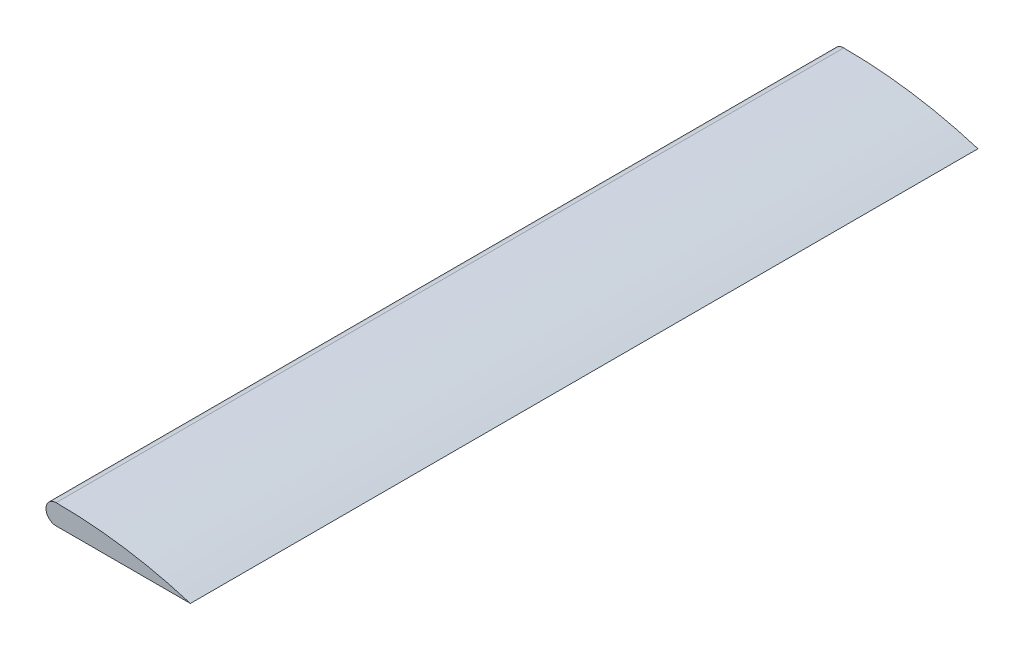
ISO-10303-21;
HEADER;
FILE_DESCRIPTION(('STEP AP214'),'2;1');
FILE_NAME('part.step','',(''),(''),'','','');
FILE_SCHEMA(('AUTOMOTIVE_DESIGN { 1 0 10303 214 1 1 1 1 }'));
ENDSEC;
DATA;
#1=APPLICATION_CONTEXT('core data for automotive mechanical design processes');
#2=APPLICATION_PROTOCOL_DEFINITION('international standard','automotive_design',2000,#1);
#3=PRODUCT_CONTEXT('',#1,'mechanical');
#4=PRODUCT('Part','Part','',(#3));
#5=PRODUCT_RELATED_PRODUCT_CATEGORY('part','',(#4));
#6=PRODUCT_DEFINITION_FORMATION('','',#4);
#7=PRODUCT_DEFINITION_CONTEXT('part definition',#1,'design');
#8=PRODUCT_DEFINITION('design','',#6,#7);
#9=PRODUCT_DEFINITION_SHAPE('','',#8);
#10=(LENGTH_UNIT() NAMED_UNIT(*) SI_UNIT(.MILLI.,.METRE.));
#11=(NAMED_UNIT(*) PLANE_ANGLE_UNIT() SI_UNIT($,.RADIAN.));
#12=(NAMED_UNIT(*) SI_UNIT($,.STERADIAN.) SOLID_ANGLE_UNIT());
#13=UNCERTAINTY_MEASURE_WITH_UNIT(LENGTH_MEASURE(1.E-05),#10,'distance_accuracy_value','');
#14=(GEOMETRIC_REPRESENTATION_CONTEXT(3) GLOBAL_UNCERTAINTY_ASSIGNED_CONTEXT((#13)) GLOBAL_UNIT_ASSIGNED_CONTEXT((#10,
#11,#12)) REPRESENTATION_CONTEXT('',''));
#15=CARTESIAN_POINT('',(0.,0.,0.));
#16=DIRECTION('',(0.,0.,1.));
#17=DIRECTION('',(1.,0.,0.));
#18=AXIS2_PLACEMENT_3D('',#15,#16,#17);
#19=CARTESIAN_POINT('',(0.,15.3731710536713,1200.));
#20=DIRECTION('',(0.,0.,-1.));
#21=DIRECTION('',(-1.,0.,0.));
#22=AXIS2_PLACEMENT_3D('',#19,#20,#21);
#23=CYLINDRICAL_SURFACE('',#22,15.3731710536713);
#24=CARTESIAN_POINT('',(0.,15.3731710536713,0.));
#25=DIRECTION('',(0.,0.,1.));
#26=DIRECTION('',(-1.,0.,0.));
#27=AXIS2_PLACEMENT_3D('',#24,#25,#26);
#28=CIRCLE('',#27,15.3731710536713);
#29=CARTESIAN_POINT('',(0.,30.7463421073426,0.));
#30=VERTEX_POINT('',#29);
#31=CARTESIAN_POINT('',(0.,0.,0.));
#32=VERTEX_POINT('',#31);
#33=EDGE_CURVE('E93',#30,#32,#28,.T.);
#34=ORIENTED_EDGE('',*,*,#33,.T.);
#35=DIRECTION('',(0.,0.,-1.));
#36=VECTOR('',#35,1.);
#37=CARTESIAN_POINT('',(0.,0.,1200.));
#38=LINE('',#37,#36);
#39=CARTESIAN_POINT('',(0.,0.,1200.));
#40=VERTEX_POINT('',#39);
#41=EDGE_CURVE('E11',#40,#32,#38,.T.);
#42=ORIENTED_EDGE('',*,*,#41,.F.);
#43=CARTESIAN_POINT('',(0.,15.3731710536713,1200.));
#44=DIRECTION('',(0.,0.,1.));
#45=DIRECTION('',(-1.,0.,0.));
#46=AXIS2_PLACEMENT_3D('',#43,#44,#45);
#47=CIRCLE('',#46,15.3731710536713);
#48=CARTESIAN_POINT('',(0.,30.7463421073426,1200.));
#49=VERTEX_POINT('',#48);
#50=EDGE_CURVE('E85',#49,#40,#47,.T.);
#51=ORIENTED_EDGE('',*,*,#50,.F.);
#52=DIRECTION('',(0.,0.,-1.));
#53=VECTOR('',#52,1.);
#54=CARTESIAN_POINT('',(0.,30.7463421073426,1200.));
#55=LINE('',#54,#53);
#56=EDGE_CURVE('E94',#49,#30,#55,.T.);
#57=ORIENTED_EDGE('',*,*,#56,.T.);
#58=EDGE_LOOP('',(#34,#42,#51,#57));
#59=FACE_BOUND('',#58,.T.);
#60=ADVANCED_FACE('F43',(#59),#23,.T.);
#61=CARTESIAN_POINT('',(0.,0.,1200.));
#62=DIRECTION('',(0.,1.,0.));
#63=DIRECTION('',(0.,0.,1.));
#64=AXIS2_PLACEMENT_3D('',#61,#62,#63);
#65=PLANE('',#64);
#66=DIRECTION('',(1.,0.,0.));
#67=VECTOR('',#66,1.);
#68=CARTESIAN_POINT('',(0.,0.,0.));
#69=LINE('',#68,#67);
#70=CARTESIAN_POINT('',(204.626828946329,0.,0.));
#71=VERTEX_POINT('',#70);
#72=EDGE_CURVE('E72',#32,#71,#69,.T.);
#73=ORIENTED_EDGE('',*,*,#72,.T.);
#74=DIRECTION('',(0.,0.,-1.));
#75=VECTOR('',#74,1.);
#76=CARTESIAN_POINT('',(204.626828946329,0.,1200.));
#77=LINE('',#76,#75);
#78=CARTESIAN_POINT('',(204.626828946329,0.,1200.));
#79=VERTEX_POINT('',#78);
#80=EDGE_CURVE('E52',#79,#71,#77,.T.);
#81=ORIENTED_EDGE('',*,*,#80,.F.);
#82=DIRECTION('',(1.,0.,0.));
#83=VECTOR('',#82,1.);
#84=CARTESIAN_POINT('',(0.,0.,1200.));
#85=LINE('',#84,#83);
#86=EDGE_CURVE('E80',#40,#79,#85,.T.);
#87=ORIENTED_EDGE('',*,*,#86,.F.);
#88=ORIENTED_EDGE('',*,*,#41,.T.);
#89=EDGE_LOOP('',(#73,#81,#87,#88));
#90=FACE_BOUND('',#89,.T.);
#91=ADVANCED_FACE('F81',(#90),#65,.F.);
#92=CARTESIAN_POINT('',(-1.1170955127606E-12,-665.55562005984,1200.));
#93=DIRECTION('',(0.,0.,-1.));
#94=DIRECTION('',(-1.,0.,0.));
#95=AXIS2_PLACEMENT_3D('',#92,#93,#94);
#96=CYLINDRICAL_SURFACE('',#95,696.301962167183);
#97=CARTESIAN_POINT('',(-1.1170955127606E-12,-665.55562005984,0.));
#98=DIRECTION('',(0.,0.,1.));
#99=DIRECTION('',(-1.,0.,0.));
#100=AXIS2_PLACEMENT_3D('',#97,#98,#99);
#101=CIRCLE('',#100,696.301962167183);
#102=EDGE_CURVE('E77',#71,#30,#101,.T.);
#103=ORIENTED_EDGE('',*,*,#102,.T.);
#104=ORIENTED_EDGE('',*,*,#56,.F.);
#105=CARTESIAN_POINT('',(-1.1170955127606E-12,-665.55562005984,1200.));
#106=DIRECTION('',(0.,0.,1.));
#107=DIRECTION('',(-1.,0.,0.));
#108=AXIS2_PLACEMENT_3D('',#105,#106,#107);
#109=CIRCLE('',#108,696.301962167183);
#110=EDGE_CURVE('E60',#79,#49,#109,.T.);
#111=ORIENTED_EDGE('',*,*,#110,.F.);
#112=ORIENTED_EDGE('',*,*,#80,.T.);
#113=EDGE_LOOP('',(#103,#104,#111,#112));
#114=FACE_BOUND('',#113,.T.);
#115=ADVANCED_FACE('F106',(#114),#96,.T.);
#116=CARTESIAN_POINT('',(0.,15.3731710536713,1200.));
#117=DIRECTION('',(0.,0.,-1.));
#118=DIRECTION('',(-1.,0.,0.));
#119=AXIS2_PLACEMENT_3D('',#116,#117,#118);
#120=PLANE('',#119);
#121=ORIENTED_EDGE('',*,*,#50,.T.);
#122=ORIENTED_EDGE('',*,*,#86,.T.);
#123=ORIENTED_EDGE('',*,*,#110,.T.);
#124=EDGE_LOOP('',(#121,#122,#123));
#125=FACE_BOUND('',#124,.T.);
#126=ADVANCED_FACE('F88',(#125),#120,.F.);
#127=CARTESIAN_POINT('',(0.,15.3731710536713,0.));
#128=DIRECTION('',(0.,0.,-1.));
#129=DIRECTION('',(-1.,0.,0.));
#130=AXIS2_PLACEMENT_3D('',#127,#128,#129);
#131=PLANE('',#130);
#132=ORIENTED_EDGE('',*,*,#33,.F.);
#133=ORIENTED_EDGE('',*,*,#102,.F.);
#134=ORIENTED_EDGE('',*,*,#72,.F.);
#135=EDGE_LOOP('',(#132,#133,#134));
#136=FACE_BOUND('',#135,.T.);
#137=ADVANCED_FACE('F107',(#136),#131,.T.);
#138=CLOSED_SHELL('',(#60,#91,#115,#126,#137));
#139=MANIFOLD_SOLID_BREP('B2',#138);
#140=ADVANCED_BREP_SHAPE_REPRESENTATION('',(#18,#139),#14);
#141=SHAPE_DEFINITION_REPRESENTATION(#9,#140);
ENDSEC;
END-ISO-10303-21;
